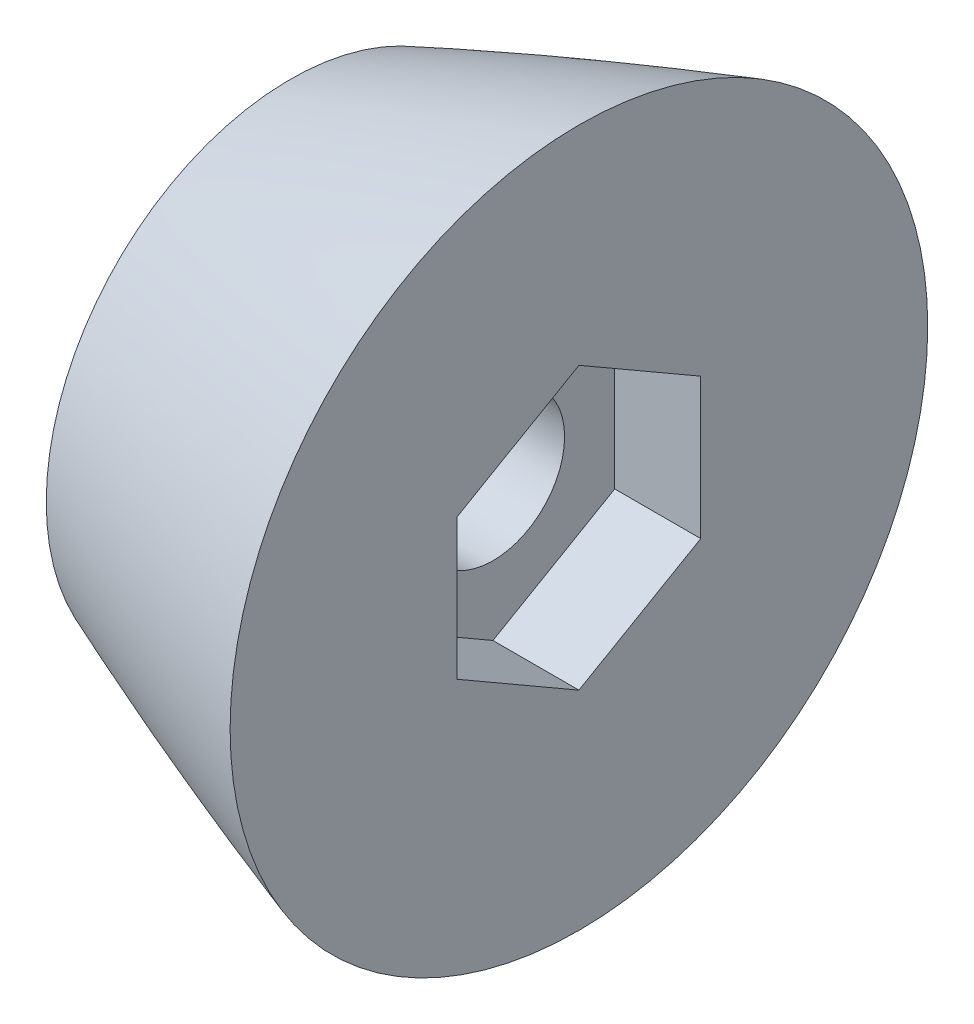
ISO-10303-21;
HEADER;
FILE_DESCRIPTION(('STEP AP214'),'2;1');
FILE_NAME('part.step','',(''),(''),'','','');
FILE_SCHEMA(('AUTOMOTIVE_DESIGN { 1 0 10303 214 1 1 1 1 }'));
ENDSEC;
DATA;
#1=APPLICATION_CONTEXT('core data for automotive mechanical design processes');
#2=APPLICATION_PROTOCOL_DEFINITION('international standard','automotive_design',2000,#1);
#3=PRODUCT_CONTEXT('',#1,'mechanical');
#4=PRODUCT('Part','Part','',(#3));
#5=PRODUCT_RELATED_PRODUCT_CATEGORY('part','',(#4));
#6=PRODUCT_DEFINITION_FORMATION('','',#4);
#7=PRODUCT_DEFINITION_CONTEXT('part definition',#1,'design');
#8=PRODUCT_DEFINITION('design','',#6,#7);
#9=PRODUCT_DEFINITION_SHAPE('','',#8);
#10=(LENGTH_UNIT() NAMED_UNIT(*) SI_UNIT(.MILLI.,.METRE.));
#11=(NAMED_UNIT(*) PLANE_ANGLE_UNIT() SI_UNIT($,.RADIAN.));
#12=(NAMED_UNIT(*) SI_UNIT($,.STERADIAN.) SOLID_ANGLE_UNIT());
#13=UNCERTAINTY_MEASURE_WITH_UNIT(LENGTH_MEASURE(1.E-05),#10,'distance_accuracy_value','');
#14=(GEOMETRIC_REPRESENTATION_CONTEXT(3) GLOBAL_UNCERTAINTY_ASSIGNED_CONTEXT((#13)) GLOBAL_UNIT_ASSIGNED_CONTEXT((#10,
#11,#12)) REPRESENTATION_CONTEXT('',''));
#15=CARTESIAN_POINT('',(0.,0.,0.));
#16=DIRECTION('',(0.,0.,1.));
#17=DIRECTION('',(1.,0.,0.));
#18=AXIS2_PLACEMENT_3D('',#15,#16,#17);
#19=CARTESIAN_POINT('',(50.1384868876885,0.,0.));
#20=DIRECTION('',(1.,0.,0.));
#21=DIRECTION('',(0.,0.,-1.));
#22=AXIS2_PLACEMENT_3D('',#19,#20,#21);
#23=PLANE('',#22);
#24=CARTESIAN_POINT('',(50.1384868876885,0.,0.));
#25=DIRECTION('',(-1.,0.,0.));
#26=DIRECTION('',(0.,0.,1.));
#27=AXIS2_PLACEMENT_3D('',#24,#25,#26);
#28=CIRCLE('',#27,24.3412865852289);
#29=CARTESIAN_POINT('',(50.1384868876885,0.,24.3412865852289));
#30=VERTEX_POINT('',#29);
#31=EDGE_CURVE('E95',#30,#30,#28,.T.);
#32=ORIENTED_EDGE('',*,*,#31,.F.);
#33=EDGE_LOOP('',(#32));
#34=FACE_BOUND('',#33,.T.);
#35=DIRECTION('',(0.,-0.5,0.866025403784439));
#36=VECTOR('',#35,1.);
#37=CARTESIAN_POINT('',(50.1384868876885,-7.36121593216773,-4.25));
#38=LINE('',#37,#36);
#39=CARTESIAN_POINT('',(50.1384868876885,-4.90747728811182,-8.5));
#40=VERTEX_POINT('',#39);
#41=CARTESIAN_POINT('',(50.1384868876885,-9.81495457622364,0.));
#42=VERTEX_POINT('',#41);
#43=EDGE_CURVE('E45',#40,#42,#38,.T.);
#44=ORIENTED_EDGE('',*,*,#43,.T.);
#45=DIRECTION('',(0.,0.5,0.866025403784439));
#46=VECTOR('',#45,1.);
#47=CARTESIAN_POINT('',(50.1384868876885,-7.36121593216773,4.25));
#48=LINE('',#47,#46);
#49=CARTESIAN_POINT('',(50.1384868876885,-4.90747728811182,8.5));
#50=VERTEX_POINT('',#49);
#51=EDGE_CURVE('E11',#42,#50,#48,.T.);
#52=ORIENTED_EDGE('',*,*,#51,.T.);
#53=DIRECTION('',(0.,1.,0.));
#54=VECTOR('',#53,1.);
#55=CARTESIAN_POINT('',(50.1384868876885,0.,8.5));
#56=LINE('',#55,#54);
#57=CARTESIAN_POINT('',(50.1384868876885,4.90747728811182,8.5));
#58=VERTEX_POINT('',#57);
#59=EDGE_CURVE('E141',#50,#58,#56,.T.);
#60=ORIENTED_EDGE('',*,*,#59,.T.);
#61=DIRECTION('',(0.,0.5,-0.866025403784439));
#62=VECTOR('',#61,1.);
#63=CARTESIAN_POINT('',(50.1384868876885,7.36121593216773,4.25));
#64=LINE('',#63,#62);
#65=CARTESIAN_POINT('',(50.1384868876885,9.81495457622364,0.));
#66=VERTEX_POINT('',#65);
#67=EDGE_CURVE('E146',#58,#66,#64,.T.);
#68=ORIENTED_EDGE('',*,*,#67,.T.);
#69=DIRECTION('',(0.,-0.5,-0.866025403784439));
#70=VECTOR('',#69,1.);
#71=CARTESIAN_POINT('',(50.1384868876885,7.36121593216773,-4.25));
#72=LINE('',#71,#70);
#73=CARTESIAN_POINT('',(50.1384868876885,4.90747728811182,-8.5));
#74=VERTEX_POINT('',#73);
#75=EDGE_CURVE('E149',#66,#74,#72,.T.);
#76=ORIENTED_EDGE('',*,*,#75,.T.);
#77=DIRECTION('',(0.,-1.,0.));
#78=VECTOR('',#77,1.);
#79=CARTESIAN_POINT('',(50.1384868876885,0.,-8.5));
#80=LINE('',#79,#78);
#81=EDGE_CURVE('E152',#74,#40,#80,.T.);
#82=ORIENTED_EDGE('',*,*,#81,.T.);
#83=EDGE_LOOP('',(#44,#52,#60,#68,#76,#82));
#84=FACE_BOUND('',#83,.T.);
#85=ADVANCED_FACE('F36',(#34,#84),#23,.T.);
#86=CARTESIAN_POINT('',(0.,0.,0.));
#87=CARTESIAN_POINT('',(0.00179561120769702,0.0115295397727473,0.));
#88=CARTESIAN_POINT('',(0.00653255162106371,0.0343082559631767,0.));
#89=CARTESIAN_POINT('',(0.0208143664424888,0.0787039224685937,0.));
#90=CARTESIAN_POINT('',(0.0565769055303668,0.16479188856365,0.));
#91=CARTESIAN_POINT('',(0.106248222344336,0.260720398265474,0.));
#92=CARTESIAN_POINT('',(0.168831034538525,0.366307006399791,0.));
#93=CARTESIAN_POINT('',(0.257283092353543,0.501671411295095,0.));
#94=CARTESIAN_POINT('',(0.394318593296146,0.693561073304218,0.));
#95=CARTESIAN_POINT('',(0.642308835878965,1.00230290250084,0.));
#96=CARTESIAN_POINT('',(1.09413881719049,1.49466103366061,0.));
#97=CARTESIAN_POINT('',(1.88111936192276,2.24160485812301,0.));
#98=CARTESIAN_POINT('',(3.22299051443268,3.35150183586812,0.));
#99=CARTESIAN_POINT('',(5.48488415561171,4.97779983228109,0.));
#100=CARTESIAN_POINT('',(9.13124211878255,7.25582751175911,0.));
#101=CARTESIAN_POINT('',(14.9211323836106,10.4011837493986,0.));
#102=CARTESIAN_POINT('',(22.887129802567,14.1539691021997,0.));
#103=CARTESIAN_POINT('',(35.1071373623822,19.2015273816733,0.));
#104=CARTESIAN_POINT('',(51.1906885735077,24.8872183765098,0.));
#105=CARTESIAN_POINT('',(70.271426107463,30.6648088909048,0.));
#106=CARTESIAN_POINT('',(92.1460318214491,36.2979014721164,0.));
#107=CARTESIAN_POINT('',(114.202164385988,41.1638470824983,0.));
#108=CARTESIAN_POINT('',(136.396259570559,45.3526727101698,0.));
#109=CARTESIAN_POINT('',(158.696515923249,48.9292308910393,0.));
#110=CARTESIAN_POINT('',(181.079729625028,51.9412298120595,0.));
#111=CARTESIAN_POINT('',(203.527006461609,54.4280223403578,0.));
#112=CARTESIAN_POINT('',(226.023091403463,56.423318788571,0.));
#113=CARTESIAN_POINT('',(248.554958992658,57.9591921651009,0.));
#114=CARTESIAN_POINT('',(271.111661384041,59.0682133277352,0.));
#115=CARTESIAN_POINT('',(293.683920122687,59.7872439933635,0.));
#116=CARTESIAN_POINT('',(316.264271184174,60.1612914806686,0.));
#117=CARTESIAN_POINT('',(333.201479382674,60.2297820388285,0.));
#118=CARTESIAN_POINT('',(344.492827198945,60.2134975758209,0.));
#119=CARTESIAN_POINT('',(350.138486887688,60.2,0.));
#120=B_SPLINE_CURVE_WITH_KNOTS('',4,(#86,#87,#88,#89,#90,#91,#92,#93,#94,#95,#96,#97,#98,#99,
#100,#101,#102,#103,#104,#105,#106,#107,#108,#109,#110,#111,#112,#113,#114,#115,#116,#117,#118,
#119),.UNSPECIFIED.,.F.,.F.,(5,1,1,1,1,1,1,1,1,1,1,1,1,1,1,1,1,1,1,1,1,1,1,1,1,1,1,1,1,1,5),(0.,
0.000129466128844724,0.000258932257689449,0.000517864515378897,0.00103572903075779,
0.00132959756262451,0.00162346609449122,0.00231609177445972,0.00365733728092563,
0.00573118828235363,0.00905026044718213,0.0143749665936698,0.0230112040457154,
0.0366942122770792,0.0568390054980255,0.0876193212926059,0.120902054625402,0.183694741824179,
0.246487461894397,0.309280168136726,0.372072878057567,0.434865590092221,0.497658301368116,
0.560451012492113,0.623243722100758,0.686036436955859,0.748829148558169,0.811621861163939,
0.874414574245631,0.937207286979147,1.),.UNSPECIFIED.);
#121=CARTESIAN_POINT('',(0.,0.,0.));
#122=DIRECTION('',(-1.,0.,0.));
#123=AXIS1_PLACEMENT('',#121,#122);
#124=SURFACE_OF_REVOLUTION('',#120,#123);
#125=CARTESIAN_POINT('',(30.,0.,0.));
#126=DIRECTION('',(-1.,0.,0.));
#127=DIRECTION('',(0.,0.,1.));
#128=AXIS2_PLACEMENT_3D('',#125,#126,#127);
#129=CIRCLE('',#128,17.0317779610394);
#130=CARTESIAN_POINT('',(30.,0.,17.0317779610394));
#131=VERTEX_POINT('',#130);
#132=EDGE_CURVE('E135',#131,#131,#129,.T.);
#133=ORIENTED_EDGE('',*,*,#132,.F.);
#134=EDGE_LOOP('',(#133));
#135=FACE_BOUND('',#134,.T.);
#136=ORIENTED_EDGE('',*,*,#31,.T.);
#137=EDGE_LOOP('',(#136));
#138=FACE_BOUND('',#137,.T.);
#139=ADVANCED_FACE('F38',(#135,#138),#124,.F.);
#140=CARTESIAN_POINT('',(30.,0.,0.));
#141=DIRECTION('',(1.,0.,0.));
#142=DIRECTION('',(0.,0.,-1.));
#143=AXIS2_PLACEMENT_3D('',#140,#141,#142);
#144=PLANE('',#143);
#145=CARTESIAN_POINT('',(30.,0.,0.));
#146=DIRECTION('',(1.,0.,0.));
#147=DIRECTION('',(0.,0.,-1.));
#148=AXIS2_PLACEMENT_3D('',#145,#146,#147);
#149=CIRCLE('',#148,5.);
#150=CARTESIAN_POINT('',(30.,0.,-5.));
#151=VERTEX_POINT('',#150);
#152=EDGE_CURVE('E110',#151,#151,#149,.T.);
#153=ORIENTED_EDGE('',*,*,#152,.T.);
#154=EDGE_LOOP('',(#153));
#155=FACE_BOUND('',#154,.T.);
#156=ORIENTED_EDGE('',*,*,#132,.T.);
#157=EDGE_LOOP('',(#156));
#158=FACE_BOUND('',#157,.T.);
#159=ADVANCED_FACE('F182',(#155,#158),#144,.F.);
#160=CARTESIAN_POINT('',(70.1384868876885,-4.90747728811182,8.5));
#161=DIRECTION('',(0.,0.866025403784439,-0.5));
#162=DIRECTION('',(0.,0.5,0.866025403784439));
#163=AXIS2_PLACEMENT_3D('',#160,#161,#162);
#164=PLANE('',#163);
#165=DIRECTION('',(-1.,0.,0.));
#166=VECTOR('',#165,1.);
#167=CARTESIAN_POINT('',(70.1384868876885,-9.81495457622364,0.));
#168=LINE('',#167,#166);
#169=CARTESIAN_POINT('',(44.1384868876885,-9.81495457622364,0.));
#170=VERTEX_POINT('',#169);
#171=EDGE_CURVE('E87',#42,#170,#168,.T.);
#172=ORIENTED_EDGE('',*,*,#171,.T.);
#173=DIRECTION('',(0.,-0.5,-0.866025403784439));
#174=VECTOR('',#173,1.);
#175=CARTESIAN_POINT('',(44.1384868876885,-4.90747728811182,8.5));
#176=LINE('',#175,#174);
#177=CARTESIAN_POINT('',(44.1384868876885,-4.90747728811182,8.5));
#178=VERTEX_POINT('',#177);
#179=EDGE_CURVE('E91',#178,#170,#176,.T.);
#180=ORIENTED_EDGE('',*,*,#179,.F.);
#181=DIRECTION('',(-1.,0.,0.));
#182=VECTOR('',#181,1.);
#183=CARTESIAN_POINT('',(70.1384868876885,-4.90747728811182,8.5));
#184=LINE('',#183,#182);
#185=EDGE_CURVE('E124',#50,#178,#184,.T.);
#186=ORIENTED_EDGE('',*,*,#185,.F.);
#187=ORIENTED_EDGE('',*,*,#51,.F.);
#188=EDGE_LOOP('',(#172,#180,#186,#187));
#189=FACE_BOUND('',#188,.T.);
#190=ADVANCED_FACE('F89',(#189),#164,.T.);
#191=CARTESIAN_POINT('',(70.1384868876885,-9.81495457622364,0.));
#192=DIRECTION('',(0.,0.866025403784439,0.5));
#193=DIRECTION('',(0.,-0.5,0.866025403784439));
#194=AXIS2_PLACEMENT_3D('',#191,#192,#193);
#195=PLANE('',#194);
#196=DIRECTION('',(-1.,0.,0.));
#197=VECTOR('',#196,1.);
#198=CARTESIAN_POINT('',(70.1384868876885,-4.90747728811182,-8.5));
#199=LINE('',#198,#197);
#200=CARTESIAN_POINT('',(44.1384868876885,-4.90747728811182,-8.5));
#201=VERTEX_POINT('',#200);
#202=EDGE_CURVE('E96',#40,#201,#199,.T.);
#203=ORIENTED_EDGE('',*,*,#202,.T.);
#204=DIRECTION('',(0.,0.5,-0.866025403784439));
#205=VECTOR('',#204,1.);
#206=CARTESIAN_POINT('',(44.1384868876885,-9.81495457622364,0.));
#207=LINE('',#206,#205);
#208=EDGE_CURVE('E99',#170,#201,#207,.T.);
#209=ORIENTED_EDGE('',*,*,#208,.F.);
#210=ORIENTED_EDGE('',*,*,#171,.F.);
#211=ORIENTED_EDGE('',*,*,#43,.F.);
#212=EDGE_LOOP('',(#203,#209,#210,#211));
#213=FACE_BOUND('',#212,.T.);
#214=ADVANCED_FACE('F100',(#213),#195,.T.);
#215=CARTESIAN_POINT('',(70.1384868876885,-4.90747728811182,-8.5));
#216=DIRECTION('',(0.,0.,1.));
#217=DIRECTION('',(1.,0.,0.));
#218=AXIS2_PLACEMENT_3D('',#215,#216,#217);
#219=PLANE('',#218);
#220=DIRECTION('',(-1.,0.,0.));
#221=VECTOR('',#220,1.);
#222=CARTESIAN_POINT('',(70.1384868876885,4.90747728811182,-8.5));
#223=LINE('',#222,#221);
#224=CARTESIAN_POINT('',(44.1384868876885,4.90747728811182,-8.5));
#225=VERTEX_POINT('',#224);
#226=EDGE_CURVE('E129',#74,#225,#223,.T.);
#227=ORIENTED_EDGE('',*,*,#226,.T.);
#228=DIRECTION('',(0.,1.,0.));
#229=VECTOR('',#228,1.);
#230=CARTESIAN_POINT('',(44.1384868876885,-4.90747728811182,-8.5));
#231=LINE('',#230,#229);
#232=EDGE_CURVE('E105',#201,#225,#231,.T.);
#233=ORIENTED_EDGE('',*,*,#232,.F.);
#234=ORIENTED_EDGE('',*,*,#202,.F.);
#235=ORIENTED_EDGE('',*,*,#81,.F.);
#236=EDGE_LOOP('',(#227,#233,#234,#235));
#237=FACE_BOUND('',#236,.T.);
#238=ADVANCED_FACE('F156',(#237),#219,.T.);
#239=CARTESIAN_POINT('',(70.1384868876885,4.90747728811182,-8.5));
#240=DIRECTION('',(0.,-0.866025403784439,0.5));
#241=DIRECTION('',(0.,-0.5,-0.866025403784439));
#242=AXIS2_PLACEMENT_3D('',#239,#240,#241);
#243=PLANE('',#242);
#244=DIRECTION('',(-1.,0.,0.));
#245=VECTOR('',#244,1.);
#246=CARTESIAN_POINT('',(70.1384868876885,9.81495457622364,0.));
#247=LINE('',#246,#245);
#248=CARTESIAN_POINT('',(44.1384868876885,9.81495457622364,0.));
#249=VERTEX_POINT('',#248);
#250=EDGE_CURVE('E127',#66,#249,#247,.T.);
#251=ORIENTED_EDGE('',*,*,#250,.T.);
#252=DIRECTION('',(0.,0.5,0.866025403784439));
#253=VECTOR('',#252,1.);
#254=CARTESIAN_POINT('',(44.1384868876885,4.90747728811182,-8.5));
#255=LINE('',#254,#253);
#256=EDGE_CURVE('E118',#225,#249,#255,.T.);
#257=ORIENTED_EDGE('',*,*,#256,.F.);
#258=ORIENTED_EDGE('',*,*,#226,.F.);
#259=ORIENTED_EDGE('',*,*,#75,.F.);
#260=EDGE_LOOP('',(#251,#257,#258,#259));
#261=FACE_BOUND('',#260,.T.);
#262=ADVANCED_FACE('F161',(#261),#243,.T.);
#263=CARTESIAN_POINT('',(70.1384868876885,9.81495457622364,0.));
#264=DIRECTION('',(0.,-0.866025403784439,-0.5));
#265=DIRECTION('',(0.,0.5,-0.866025403784439));
#266=AXIS2_PLACEMENT_3D('',#263,#264,#265);
#267=PLANE('',#266);
#268=DIRECTION('',(-1.,0.,0.));
#269=VECTOR('',#268,1.);
#270=CARTESIAN_POINT('',(70.1384868876885,4.90747728811182,8.5));
#271=LINE('',#270,#269);
#272=CARTESIAN_POINT('',(44.1384868876885,4.90747728811182,8.5));
#273=VERTEX_POINT('',#272);
#274=EDGE_CURVE('E52',#58,#273,#271,.T.);
#275=ORIENTED_EDGE('',*,*,#274,.T.);
#276=DIRECTION('',(0.,-0.5,0.866025403784439));
#277=VECTOR('',#276,1.);
#278=CARTESIAN_POINT('',(44.1384868876885,9.81495457622364,0.));
#279=LINE('',#278,#277);
#280=EDGE_CURVE('E121',#249,#273,#279,.T.);
#281=ORIENTED_EDGE('',*,*,#280,.F.);
#282=ORIENTED_EDGE('',*,*,#250,.F.);
#283=ORIENTED_EDGE('',*,*,#67,.F.);
#284=EDGE_LOOP('',(#275,#281,#282,#283));
#285=FACE_BOUND('',#284,.T.);
#286=ADVANCED_FACE('F164',(#285),#267,.T.);
#287=CARTESIAN_POINT('',(70.1384868876885,4.90747728811182,8.5));
#288=DIRECTION('',(0.,0.,-1.));
#289=DIRECTION('',(0.,1.,0.));
#290=AXIS2_PLACEMENT_3D('',#287,#288,#289);
#291=PLANE('',#290);
#292=ORIENTED_EDGE('',*,*,#185,.T.);
#293=DIRECTION('',(0.,-1.,0.));
#294=VECTOR('',#293,1.);
#295=CARTESIAN_POINT('',(44.1384868876885,4.90747728811182,8.5));
#296=LINE('',#295,#294);
#297=EDGE_CURVE('E109',#273,#178,#296,.T.);
#298=ORIENTED_EDGE('',*,*,#297,.F.);
#299=ORIENTED_EDGE('',*,*,#274,.F.);
#300=ORIENTED_EDGE('',*,*,#59,.F.);
#301=EDGE_LOOP('',(#292,#298,#299,#300));
#302=FACE_BOUND('',#301,.T.);
#303=ADVANCED_FACE('F165',(#302),#291,.T.);
#304=CARTESIAN_POINT('',(44.1384868876885,0.,0.));
#305=DIRECTION('',(1.,0.,0.));
#306=DIRECTION('',(0.,0.,-1.));
#307=AXIS2_PLACEMENT_3D('',#304,#305,#306);
#308=PLANE('',#307);
#309=CARTESIAN_POINT('',(44.1384868876885,0.,0.));
#310=DIRECTION('',(1.,0.,0.));
#311=DIRECTION('',(0.,0.,-1.));
#312=AXIS2_PLACEMENT_3D('',#309,#310,#311);
#313=CIRCLE('',#312,5.);
#314=CARTESIAN_POINT('',(44.1384868876885,0.,-5.));
#315=VERTEX_POINT('',#314);
#316=EDGE_CURVE('E113',#315,#315,#313,.T.);
#317=ORIENTED_EDGE('',*,*,#316,.F.);
#318=EDGE_LOOP('',(#317));
#319=FACE_BOUND('',#318,.T.);
#320=ORIENTED_EDGE('',*,*,#179,.T.);
#321=ORIENTED_EDGE('',*,*,#208,.T.);
#322=ORIENTED_EDGE('',*,*,#232,.T.);
#323=ORIENTED_EDGE('',*,*,#256,.T.);
#324=ORIENTED_EDGE('',*,*,#280,.T.);
#325=ORIENTED_EDGE('',*,*,#297,.T.);
#326=EDGE_LOOP('',(#320,#321,#322,#323,#324,#325));
#327=FACE_BOUND('',#326,.T.);
#328=ADVANCED_FACE('F107',(#319,#327),#308,.T.);
#329=CARTESIAN_POINT('',(30.,0.,0.));
#330=DIRECTION('',(1.,0.,0.));
#331=DIRECTION('',(0.,0.,-1.));
#332=AXIS2_PLACEMENT_3D('',#329,#330,#331);
#333=CYLINDRICAL_SURFACE('',#332,5.);
#334=ORIENTED_EDGE('',*,*,#152,.F.);
#335=EDGE_LOOP('',(#334));
#336=FACE_BOUND('',#335,.T.);
#337=ORIENTED_EDGE('',*,*,#316,.T.);
#338=EDGE_LOOP('',(#337));
#339=FACE_BOUND('',#338,.T.);
#340=ADVANCED_FACE('F172',(#336,#339),#333,.F.);
#341=CLOSED_SHELL('',(#85,#139,#159,#190,#214,#238,#262,#286,#303,#328,#340));
#342=MANIFOLD_SOLID_BREP('B2',#341);
#343=ADVANCED_BREP_SHAPE_REPRESENTATION('',(#18,#342),#14);
#344=SHAPE_DEFINITION_REPRESENTATION(#9,#343);
ENDSEC;
END-ISO-10303-21;
